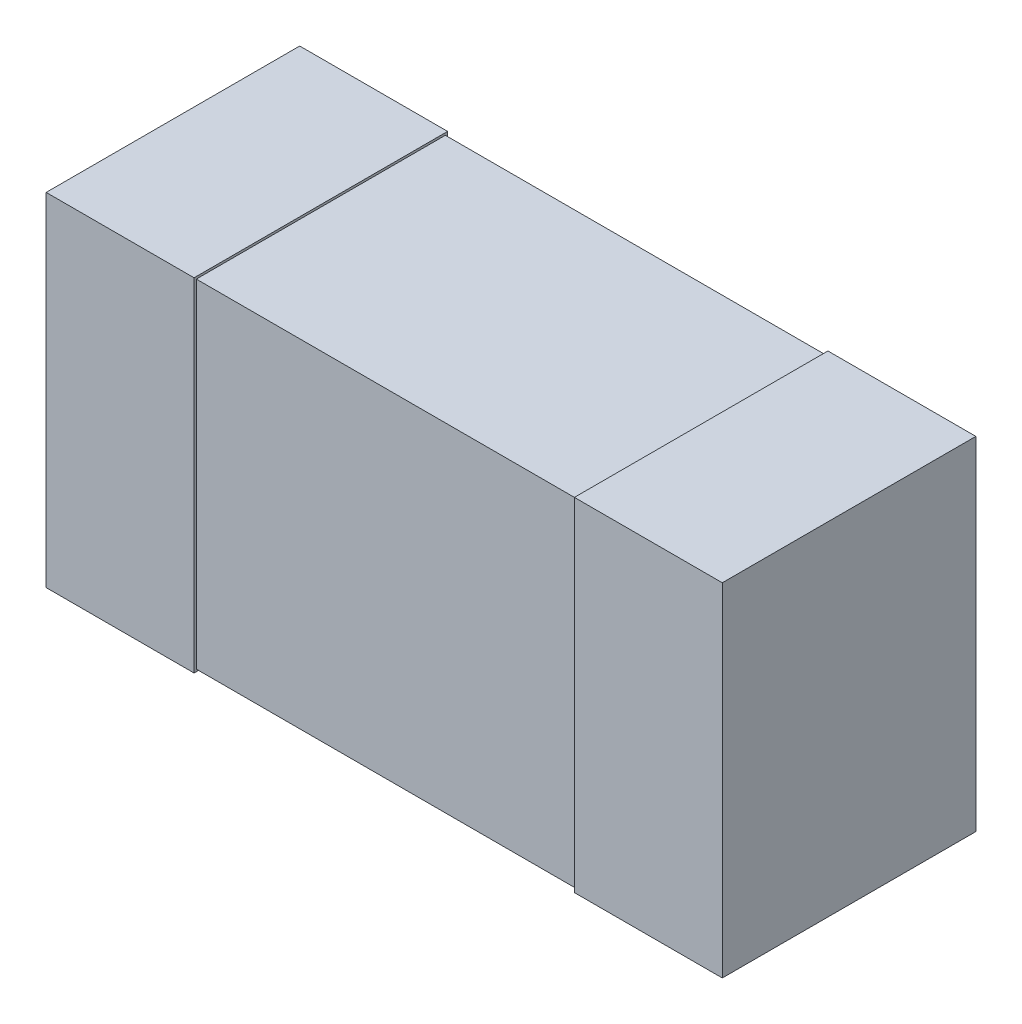
ISO-10303-21;
HEADER;
FILE_DESCRIPTION(('STEP AP214'),'2;1');
FILE_NAME('part.step','',(''),(''),'','','');
FILE_SCHEMA(('AUTOMOTIVE_DESIGN { 1 0 10303 214 1 1 1 1 }'));
ENDSEC;
DATA;
#1=APPLICATION_CONTEXT('core data for automotive mechanical design processes');
#2=APPLICATION_PROTOCOL_DEFINITION('international standard','automotive_design',2000,#1);
#3=PRODUCT_CONTEXT('',#1,'mechanical');
#4=PRODUCT('Part','Part','',(#3));
#5=PRODUCT_RELATED_PRODUCT_CATEGORY('part','',(#4));
#6=PRODUCT_DEFINITION_FORMATION('','',#4);
#7=PRODUCT_DEFINITION_CONTEXT('part definition',#1,'design');
#8=PRODUCT_DEFINITION('design','',#6,#7);
#9=PRODUCT_DEFINITION_SHAPE('','',#8);
#10=(LENGTH_UNIT() NAMED_UNIT(*) SI_UNIT(.MILLI.,.METRE.));
#11=(NAMED_UNIT(*) PLANE_ANGLE_UNIT() SI_UNIT($,.RADIAN.));
#12=(NAMED_UNIT(*) SI_UNIT($,.STERADIAN.) SOLID_ANGLE_UNIT());
#13=UNCERTAINTY_MEASURE_WITH_UNIT(LENGTH_MEASURE(1.E-05),#10,'distance_accuracy_value','');
#14=(GEOMETRIC_REPRESENTATION_CONTEXT(3) GLOBAL_UNCERTAINTY_ASSIGNED_CONTEXT((#13)) GLOBAL_UNIT_ASSIGNED_CONTEXT((#10,
#11,#12)) REPRESENTATION_CONTEXT('',''));
#15=CARTESIAN_POINT('',(0.,0.,0.));
#16=DIRECTION('',(0.,0.,1.));
#17=DIRECTION('',(1.,0.,0.));
#18=AXIS2_PLACEMENT_3D('',#15,#16,#17);
#19=CARTESIAN_POINT('',(0.8,-0.405,0.0762));
#20=DIRECTION('',(1.,0.,0.));
#21=DIRECTION('',(0.,1.,0.));
#22=AXIS2_PLACEMENT_3D('',#19,#20,#21);
#23=PLANE('',#22);
#24=DIRECTION('',(0.,1.,0.));
#25=VECTOR('',#24,1.);
#26=CARTESIAN_POINT('',(0.8,-0.405,0.0762));
#27=LINE('',#26,#25);
#28=CARTESIAN_POINT('',(0.8,-0.405,0.0762));
#29=VERTEX_POINT('',#28);
#30=CARTESIAN_POINT('',(0.8,0.405,0.0762));
#31=VERTEX_POINT('',#30);
#32=EDGE_CURVE('E189',#29,#31,#27,.T.);
#33=ORIENTED_EDGE('',*,*,#32,.T.);
#34=DIRECTION('',(0.,0.,1.));
#35=VECTOR('',#34,1.);
#36=CARTESIAN_POINT('',(0.8,0.405,0.0762));
#37=LINE('',#36,#35);
#38=CARTESIAN_POINT('',(0.8,0.405,0.6762));
#39=VERTEX_POINT('',#38);
#40=EDGE_CURVE('E205',#31,#39,#37,.T.);
#41=ORIENTED_EDGE('',*,*,#40,.T.);
#42=DIRECTION('',(0.,1.,0.));
#43=VECTOR('',#42,1.);
#44=CARTESIAN_POINT('',(0.8,-0.405,0.6762));
#45=LINE('',#44,#43);
#46=CARTESIAN_POINT('',(0.8,-0.405,0.6762));
#47=VERTEX_POINT('',#46);
#48=EDGE_CURVE('E224',#47,#39,#45,.T.);
#49=ORIENTED_EDGE('',*,*,#48,.F.);
#50=DIRECTION('',(0.,0.,1.));
#51=VECTOR('',#50,1.);
#52=CARTESIAN_POINT('',(0.8,-0.405,0.0762));
#53=LINE('',#52,#51);
#54=EDGE_CURVE('E11',#29,#47,#53,.T.);
#55=ORIENTED_EDGE('',*,*,#54,.F.);
#56=EDGE_LOOP('',(#33,#41,#49,#55));
#57=FACE_BOUND('',#56,.T.);
#58=ADVANCED_FACE('F17',(#57),#23,.T.);
#59=CARTESIAN_POINT('',(-0.8,0.405,0.0762));
#60=DIRECTION('',(-1.,0.,0.));
#61=DIRECTION('',(0.,0.,1.));
#62=AXIS2_PLACEMENT_3D('',#59,#60,#61);
#63=PLANE('',#62);
#64=DIRECTION('',(0.,-1.,0.));
#65=VECTOR('',#64,1.);
#66=CARTESIAN_POINT('',(-0.8,0.405,0.0762));
#67=LINE('',#66,#65);
#68=CARTESIAN_POINT('',(-0.8,0.405,0.0762));
#69=VERTEX_POINT('',#68);
#70=CARTESIAN_POINT('',(-0.8,-0.405,0.0762));
#71=VERTEX_POINT('',#70);
#72=EDGE_CURVE('E203',#69,#71,#67,.T.);
#73=ORIENTED_EDGE('',*,*,#72,.T.);
#74=DIRECTION('',(0.,0.,1.));
#75=VECTOR('',#74,1.);
#76=CARTESIAN_POINT('',(-0.8,-0.405,0.0762));
#77=LINE('',#76,#75);
#78=CARTESIAN_POINT('',(-0.8,-0.405,0.6762));
#79=VERTEX_POINT('',#78);
#80=EDGE_CURVE('E28',#71,#79,#77,.T.);
#81=ORIENTED_EDGE('',*,*,#80,.T.);
#82=DIRECTION('',(0.,-1.,0.));
#83=VECTOR('',#82,1.);
#84=CARTESIAN_POINT('',(-0.8,0.405,0.6762));
#85=LINE('',#84,#83);
#86=CARTESIAN_POINT('',(-0.8,0.405,0.6762));
#87=VERTEX_POINT('',#86);
#88=EDGE_CURVE('E208',#87,#79,#85,.T.);
#89=ORIENTED_EDGE('',*,*,#88,.F.);
#90=DIRECTION('',(0.,0.,1.));
#91=VECTOR('',#90,1.);
#92=CARTESIAN_POINT('',(-0.8,0.405,0.0762));
#93=LINE('',#92,#91);
#94=EDGE_CURVE('E181',#69,#87,#93,.T.);
#95=ORIENTED_EDGE('',*,*,#94,.F.);
#96=EDGE_LOOP('',(#73,#81,#89,#95));
#97=FACE_BOUND('',#96,.T.);
#98=ADVANCED_FACE('F19',(#97),#63,.T.);
#99=CARTESIAN_POINT('',(-0.8,-0.405,0.0762));
#100=DIRECTION('',(0.,-1.,0.));
#101=DIRECTION('',(0.,0.,-1.));
#102=AXIS2_PLACEMENT_3D('',#99,#100,#101);
#103=PLANE('',#102);
#104=DIRECTION('',(0.,0.,1.));
#105=VECTOR('',#104,1.);
#106=CARTESIAN_POINT('',(0.45,-0.405,0.0762));
#107=LINE('',#106,#105);
#108=CARTESIAN_POINT('',(0.45,-0.405,0.0762));
#109=VERTEX_POINT('',#108);
#110=CARTESIAN_POINT('',(0.45,-0.405,0.6762));
#111=VERTEX_POINT('',#110);
#112=EDGE_CURVE('E175',#109,#111,#107,.T.);
#113=ORIENTED_EDGE('',*,*,#112,.F.);
#114=DIRECTION('',(1.,0.,0.));
#115=VECTOR('',#114,1.);
#116=CARTESIAN_POINT('',(0.45,-0.405,0.0762));
#117=LINE('',#116,#115);
#118=EDGE_CURVE('E192',#109,#29,#117,.T.);
#119=ORIENTED_EDGE('',*,*,#118,.T.);
#120=ORIENTED_EDGE('',*,*,#54,.T.);
#121=DIRECTION('',(1.,0.,0.));
#122=VECTOR('',#121,1.);
#123=CARTESIAN_POINT('',(0.45,-0.405,0.6762));
#124=LINE('',#123,#122);
#125=EDGE_CURVE('E238',#111,#47,#124,.T.);
#126=ORIENTED_EDGE('',*,*,#125,.F.);
#127=EDGE_LOOP('',(#113,#119,#120,#126));
#128=FACE_BOUND('',#127,.T.);
#129=ADVANCED_FACE('F395',(#128),#103,.T.);
#130=CARTESIAN_POINT('',(-0.8,-0.405,0.0762));
#131=DIRECTION('',(0.,-1.,0.));
#132=DIRECTION('',(0.,0.,-1.));
#133=AXIS2_PLACEMENT_3D('',#130,#131,#132);
#134=PLANE('',#133);
#135=DIRECTION('',(0.,0.,1.));
#136=VECTOR('',#135,1.);
#137=CARTESIAN_POINT('',(-0.45,-0.405,0.0762));
#138=LINE('',#137,#136);
#139=CARTESIAN_POINT('',(-0.45,-0.405,0.0762));
#140=VERTEX_POINT('',#139);
#141=CARTESIAN_POINT('',(-0.45,-0.405,0.6762));
#142=VERTEX_POINT('',#141);
#143=EDGE_CURVE('E169',#140,#142,#138,.T.);
#144=ORIENTED_EDGE('',*,*,#143,.T.);
#145=DIRECTION('',(1.,0.,0.));
#146=VECTOR('',#145,1.);
#147=CARTESIAN_POINT('',(-0.8,-0.405,0.6762));
#148=LINE('',#147,#146);
#149=EDGE_CURVE('E228',#79,#142,#148,.T.);
#150=ORIENTED_EDGE('',*,*,#149,.F.);
#151=ORIENTED_EDGE('',*,*,#80,.F.);
#152=DIRECTION('',(1.,0.,0.));
#153=VECTOR('',#152,1.);
#154=CARTESIAN_POINT('',(-0.8,-0.405,0.0762));
#155=LINE('',#154,#153);
#156=EDGE_CURVE('E199',#71,#140,#155,.T.);
#157=ORIENTED_EDGE('',*,*,#156,.T.);
#158=EDGE_LOOP('',(#144,#150,#151,#157));
#159=FACE_BOUND('',#158,.T.);
#160=ADVANCED_FACE('F267',(#159),#134,.T.);
#161=CARTESIAN_POINT('',(0.,0.,0.6762));
#162=DIRECTION('',(0.,0.,1.));
#163=DIRECTION('',(1.,0.,0.));
#164=AXIS2_PLACEMENT_3D('',#161,#162,#163);
#165=PLANE('',#164);
#166=DIRECTION('',(0.,1.,0.));
#167=VECTOR('',#166,1.);
#168=CARTESIAN_POINT('',(0.45,-0.405,0.6762));
#169=LINE('',#168,#167);
#170=CARTESIAN_POINT('',(0.45,0.405,0.6762));
#171=VERTEX_POINT('',#170);
#172=EDGE_CURVE('E170',#111,#171,#169,.T.);
#173=ORIENTED_EDGE('',*,*,#172,.F.);
#174=ORIENTED_EDGE('',*,*,#125,.T.);
#175=ORIENTED_EDGE('',*,*,#48,.T.);
#176=DIRECTION('',(-1.,0.,0.));
#177=VECTOR('',#176,1.);
#178=CARTESIAN_POINT('',(0.8,0.405,0.6762));
#179=LINE('',#178,#177);
#180=EDGE_CURVE('E180',#39,#171,#179,.T.);
#181=ORIENTED_EDGE('',*,*,#180,.T.);
#182=EDGE_LOOP('',(#173,#174,#175,#181));
#183=FACE_BOUND('',#182,.T.);
#184=ADVANCED_FACE('F398',(#183),#165,.T.);
#185=CARTESIAN_POINT('',(0.,0.,0.6762));
#186=DIRECTION('',(0.,0.,1.));
#187=DIRECTION('',(1.,0.,0.));
#188=AXIS2_PLACEMENT_3D('',#185,#186,#187);
#189=PLANE('',#188);
#190=DIRECTION('',(0.,1.,0.));
#191=VECTOR('',#190,1.);
#192=CARTESIAN_POINT('',(-0.45,-0.405,0.6762));
#193=LINE('',#192,#191);
#194=CARTESIAN_POINT('',(-0.45,0.405,0.6762));
#195=VERTEX_POINT('',#194);
#196=EDGE_CURVE('E21',#142,#195,#193,.T.);
#197=ORIENTED_EDGE('',*,*,#196,.T.);
#198=DIRECTION('',(-1.,0.,0.));
#199=VECTOR('',#198,1.);
#200=CARTESIAN_POINT('',(-0.45,0.405,0.6762));
#201=LINE('',#200,#199);
#202=EDGE_CURVE('E176',#195,#87,#201,.T.);
#203=ORIENTED_EDGE('',*,*,#202,.T.);
#204=ORIENTED_EDGE('',*,*,#88,.T.);
#205=ORIENTED_EDGE('',*,*,#149,.T.);
#206=EDGE_LOOP('',(#197,#203,#204,#205));
#207=FACE_BOUND('',#206,.T.);
#208=ADVANCED_FACE('F264',(#207),#189,.T.);
#209=CARTESIAN_POINT('',(0.8,0.405,0.0762));
#210=DIRECTION('',(0.,1.,0.));
#211=DIRECTION('',(1.,0.,0.));
#212=AXIS2_PLACEMENT_3D('',#209,#210,#211);
#213=PLANE('',#212);
#214=DIRECTION('',(0.,0.,1.));
#215=VECTOR('',#214,1.);
#216=CARTESIAN_POINT('',(0.45,0.405,0.0762));
#217=LINE('',#216,#215);
#218=CARTESIAN_POINT('',(0.45,0.405,0.0762));
#219=VERTEX_POINT('',#218);
#220=EDGE_CURVE('E174',#219,#171,#217,.T.);
#221=ORIENTED_EDGE('',*,*,#220,.T.);
#222=ORIENTED_EDGE('',*,*,#180,.F.);
#223=ORIENTED_EDGE('',*,*,#40,.F.);
#224=DIRECTION('',(-1.,0.,0.));
#225=VECTOR('',#224,1.);
#226=CARTESIAN_POINT('',(0.8,0.405,0.0762));
#227=LINE('',#226,#225);
#228=EDGE_CURVE('E186',#31,#219,#227,.T.);
#229=ORIENTED_EDGE('',*,*,#228,.T.);
#230=EDGE_LOOP('',(#221,#222,#223,#229));
#231=FACE_BOUND('',#230,.T.);
#232=ADVANCED_FACE('F405',(#231),#213,.T.);
#233=CARTESIAN_POINT('',(0.8,0.405,0.0762));
#234=DIRECTION('',(0.,1.,0.));
#235=DIRECTION('',(1.,0.,0.));
#236=AXIS2_PLACEMENT_3D('',#233,#234,#235);
#237=PLANE('',#236);
#238=DIRECTION('',(0.,0.,1.));
#239=VECTOR('',#238,1.);
#240=CARTESIAN_POINT('',(-0.45,0.405,0.0762));
#241=LINE('',#240,#239);
#242=CARTESIAN_POINT('',(-0.45,0.405,0.0762));
#243=VERTEX_POINT('',#242);
#244=EDGE_CURVE('E195',#243,#195,#241,.T.);
#245=ORIENTED_EDGE('',*,*,#244,.F.);
#246=DIRECTION('',(-1.,0.,0.));
#247=VECTOR('',#246,1.);
#248=CARTESIAN_POINT('',(-0.45,0.405,0.0762));
#249=LINE('',#248,#247);
#250=EDGE_CURVE('E213',#243,#69,#249,.T.);
#251=ORIENTED_EDGE('',*,*,#250,.T.);
#252=ORIENTED_EDGE('',*,*,#94,.T.);
#253=ORIENTED_EDGE('',*,*,#202,.F.);
#254=EDGE_LOOP('',(#245,#251,#252,#253));
#255=FACE_BOUND('',#254,.T.);
#256=ADVANCED_FACE('F402',(#255),#237,.T.);
#257=CARTESIAN_POINT('',(0.45,-0.405,0.081534));
#258=DIRECTION('',(1.,0.,0.));
#259=DIRECTION('',(0.,1.,0.));
#260=AXIS2_PLACEMENT_3D('',#257,#258,#259);
#261=PLANE('',#260);
#262=DIRECTION('',(0.,1.,0.));
#263=VECTOR('',#262,1.);
#264=CARTESIAN_POINT('',(0.45,-0.399666,0.081534));
#265=LINE('',#264,#263);
#266=CARTESIAN_POINT('',(0.45,-0.399666,0.081534));
#267=VERTEX_POINT('',#266);
#268=CARTESIAN_POINT('',(0.45,0.399666,0.081534));
#269=VERTEX_POINT('',#268);
#270=EDGE_CURVE('E185',#267,#269,#265,.T.);
#271=ORIENTED_EDGE('',*,*,#270,.T.);
#272=DIRECTION('',(0.,0.,1.));
#273=VECTOR('',#272,1.);
#274=CARTESIAN_POINT('',(0.45,0.399666,0.081534));
#275=LINE('',#274,#273);
#276=CARTESIAN_POINT('',(0.45,0.399666,0.670866));
#277=VERTEX_POINT('',#276);
#278=EDGE_CURVE('E136',#269,#277,#275,.T.);
#279=ORIENTED_EDGE('',*,*,#278,.T.);
#280=DIRECTION('',(0.,-1.,0.));
#281=VECTOR('',#280,1.);
#282=CARTESIAN_POINT('',(0.45,0.399666,0.670866));
#283=LINE('',#282,#281);
#284=CARTESIAN_POINT('',(0.45,-0.399666,0.670866));
#285=VERTEX_POINT('',#284);
#286=EDGE_CURVE('E139',#277,#285,#283,.T.);
#287=ORIENTED_EDGE('',*,*,#286,.T.);
#288=DIRECTION('',(0.,0.,-1.));
#289=VECTOR('',#288,1.);
#290=CARTESIAN_POINT('',(0.45,-0.399666,0.670866));
#291=LINE('',#290,#289);
#292=EDGE_CURVE('E221',#285,#267,#291,.T.);
#293=ORIENTED_EDGE('',*,*,#292,.T.);
#294=EDGE_LOOP('',(#271,#279,#287,#293));
#295=FACE_BOUND('',#294,.T.);
#296=DIRECTION('',(0.,1.,0.));
#297=VECTOR('',#296,1.);
#298=CARTESIAN_POINT('',(0.45,-0.405,0.0762));
#299=LINE('',#298,#297);
#300=EDGE_CURVE('E190',#109,#219,#299,.T.);
#301=ORIENTED_EDGE('',*,*,#300,.F.);
#302=ORIENTED_EDGE('',*,*,#112,.T.);
#303=ORIENTED_EDGE('',*,*,#172,.T.);
#304=ORIENTED_EDGE('',*,*,#220,.F.);
#305=EDGE_LOOP('',(#301,#302,#303,#304));
#306=FACE_BOUND('',#305,.T.);
#307=ADVANCED_FACE('F372',(#295,#306),#261,.F.);
#308=CARTESIAN_POINT('',(-0.45,-0.405,0.081534));
#309=DIRECTION('',(0.,0.,1.));
#310=DIRECTION('',(1.,0.,0.));
#311=AXIS2_PLACEMENT_3D('',#308,#309,#310);
#312=PLANE('',#311);
#313=DIRECTION('',(1.,0.,0.));
#314=VECTOR('',#313,1.);
#315=CARTESIAN_POINT('',(-0.45,-0.399666,0.081534));
#316=LINE('',#315,#314);
#317=CARTESIAN_POINT('',(-0.45,-0.399666,0.081534));
#318=VERTEX_POINT('',#317);
#319=EDGE_CURVE('E144',#318,#267,#316,.T.);
#320=ORIENTED_EDGE('',*,*,#319,.F.);
#321=DIRECTION('',(0.,1.,0.));
#322=VECTOR('',#321,1.);
#323=CARTESIAN_POINT('',(-0.45,-0.399666,0.081534));
#324=LINE('',#323,#322);
#325=CARTESIAN_POINT('',(-0.45,0.399666,0.081534));
#326=VERTEX_POINT('',#325);
#327=EDGE_CURVE('E141',#318,#326,#324,.T.);
#328=ORIENTED_EDGE('',*,*,#327,.T.);
#329=DIRECTION('',(1.,0.,0.));
#330=VECTOR('',#329,1.);
#331=CARTESIAN_POINT('',(-0.45,0.399666,0.081534));
#332=LINE('',#331,#330);
#333=EDGE_CURVE('E129',#326,#269,#332,.T.);
#334=ORIENTED_EDGE('',*,*,#333,.T.);
#335=ORIENTED_EDGE('',*,*,#270,.F.);
#336=EDGE_LOOP('',(#320,#328,#334,#335));
#337=FACE_BOUND('',#336,.T.);
#338=ADVANCED_FACE('F142',(#337),#312,.F.);
#339=CARTESIAN_POINT('',(-0.45,0.399666,0.0762));
#340=DIRECTION('',(0.,-1.,0.));
#341=DIRECTION('',(0.,0.,-1.));
#342=AXIS2_PLACEMENT_3D('',#339,#340,#341);
#343=PLANE('',#342);
#344=ORIENTED_EDGE('',*,*,#333,.F.);
#345=DIRECTION('',(0.,0.,1.));
#346=VECTOR('',#345,1.);
#347=CARTESIAN_POINT('',(-0.45,0.399666,0.081534));
#348=LINE('',#347,#346);
#349=CARTESIAN_POINT('',(-0.45,0.399666,0.670866));
#350=VERTEX_POINT('',#349);
#351=EDGE_CURVE('E134',#326,#350,#348,.T.);
#352=ORIENTED_EDGE('',*,*,#351,.T.);
#353=DIRECTION('',(1.,0.,0.));
#354=VECTOR('',#353,1.);
#355=CARTESIAN_POINT('',(-0.45,0.399666,0.670866));
#356=LINE('',#355,#354);
#357=EDGE_CURVE('E165',#350,#277,#356,.T.);
#358=ORIENTED_EDGE('',*,*,#357,.T.);
#359=ORIENTED_EDGE('',*,*,#278,.F.);
#360=EDGE_LOOP('',(#344,#352,#358,#359));
#361=FACE_BOUND('',#360,.T.);
#362=ADVANCED_FACE('F131',(#361),#343,.F.);
#363=CARTESIAN_POINT('',(-0.45,0.405,0.670866));
#364=DIRECTION('',(0.,0.,-1.));
#365=DIRECTION('',(0.,-1.,0.));
#366=AXIS2_PLACEMENT_3D('',#363,#364,#365);
#367=PLANE('',#366);
#368=ORIENTED_EDGE('',*,*,#357,.F.);
#369=DIRECTION('',(0.,-1.,0.));
#370=VECTOR('',#369,1.);
#371=CARTESIAN_POINT('',(-0.45,0.399666,0.670866));
#372=LINE('',#371,#370);
#373=CARTESIAN_POINT('',(-0.45,-0.399666,0.670866));
#374=VERTEX_POINT('',#373);
#375=EDGE_CURVE('E154',#350,#374,#372,.T.);
#376=ORIENTED_EDGE('',*,*,#375,.T.);
#377=DIRECTION('',(1.,0.,0.));
#378=VECTOR('',#377,1.);
#379=CARTESIAN_POINT('',(-0.45,-0.399666,0.670866));
#380=LINE('',#379,#378);
#381=EDGE_CURVE('E149',#374,#285,#380,.T.);
#382=ORIENTED_EDGE('',*,*,#381,.T.);
#383=ORIENTED_EDGE('',*,*,#286,.F.);
#384=EDGE_LOOP('',(#368,#376,#382,#383));
#385=FACE_BOUND('',#384,.T.);
#386=ADVANCED_FACE('F371',(#385),#367,.F.);
#387=CARTESIAN_POINT('',(-0.45,-0.399666,0.6762));
#388=DIRECTION('',(0.,1.,0.));
#389=DIRECTION('',(1.,0.,0.));
#390=AXIS2_PLACEMENT_3D('',#387,#388,#389);
#391=PLANE('',#390);
#392=ORIENTED_EDGE('',*,*,#381,.F.);
#393=DIRECTION('',(0.,0.,-1.));
#394=VECTOR('',#393,1.);
#395=CARTESIAN_POINT('',(-0.45,-0.399666,0.670866));
#396=LINE('',#395,#394);
#397=EDGE_CURVE('E161',#374,#318,#396,.T.);
#398=ORIENTED_EDGE('',*,*,#397,.T.);
#399=ORIENTED_EDGE('',*,*,#319,.T.);
#400=ORIENTED_EDGE('',*,*,#292,.F.);
#401=EDGE_LOOP('',(#392,#398,#399,#400));
#402=FACE_BOUND('',#401,.T.);
#403=ADVANCED_FACE('F375',(#402),#391,.F.);
#404=CARTESIAN_POINT('',(-0.45,-0.405,0.0762));
#405=DIRECTION('',(-1.,0.,0.));
#406=DIRECTION('',(0.,0.,1.));
#407=AXIS2_PLACEMENT_3D('',#404,#405,#406);
#408=PLANE('',#407);
#409=ORIENTED_EDGE('',*,*,#397,.F.);
#410=ORIENTED_EDGE('',*,*,#375,.F.);
#411=ORIENTED_EDGE('',*,*,#351,.F.);
#412=ORIENTED_EDGE('',*,*,#327,.F.);
#413=EDGE_LOOP('',(#409,#410,#411,#412));
#414=FACE_BOUND('',#413,.T.);
#415=DIRECTION('',(0.,1.,0.));
#416=VECTOR('',#415,1.);
#417=CARTESIAN_POINT('',(-0.45,-0.405,0.0762));
#418=LINE('',#417,#416);
#419=EDGE_CURVE('E204',#140,#243,#418,.T.);
#420=ORIENTED_EDGE('',*,*,#419,.T.);
#421=ORIENTED_EDGE('',*,*,#244,.T.);
#422=ORIENTED_EDGE('',*,*,#196,.F.);
#423=ORIENTED_EDGE('',*,*,#143,.F.);
#424=EDGE_LOOP('',(#420,#421,#422,#423));
#425=FACE_BOUND('',#424,.T.);
#426=ADVANCED_FACE('F151',(#414,#425),#408,.F.);
#427=CARTESIAN_POINT('',(0.,0.,0.0762));
#428=DIRECTION('',(0.,0.,1.));
#429=DIRECTION('',(1.,0.,0.));
#430=AXIS2_PLACEMENT_3D('',#427,#428,#429);
#431=PLANE('',#430);
#432=ORIENTED_EDGE('',*,*,#300,.T.);
#433=ORIENTED_EDGE('',*,*,#228,.F.);
#434=ORIENTED_EDGE('',*,*,#32,.F.);
#435=ORIENTED_EDGE('',*,*,#118,.F.);
#436=EDGE_LOOP('',(#432,#433,#434,#435));
#437=FACE_BOUND('',#436,.T.);
#438=ADVANCED_FACE('F383',(#437),#431,.F.);
#439=CARTESIAN_POINT('',(0.,0.,0.0762));
#440=DIRECTION('',(0.,0.,1.));
#441=DIRECTION('',(1.,0.,0.));
#442=AXIS2_PLACEMENT_3D('',#439,#440,#441);
#443=PLANE('',#442);
#444=ORIENTED_EDGE('',*,*,#419,.F.);
#445=ORIENTED_EDGE('',*,*,#156,.F.);
#446=ORIENTED_EDGE('',*,*,#72,.F.);
#447=ORIENTED_EDGE('',*,*,#250,.F.);
#448=EDGE_LOOP('',(#444,#445,#446,#447));
#449=FACE_BOUND('',#448,.T.);
#450=ADVANCED_FACE('F413',(#449),#443,.F.);
#451=CLOSED_SHELL('',(#58,#98,#129,#160,#184,#208,#232,#256,#307,#338,#362,#386,#403,#426,#438,#450));
#452=MANIFOLD_SOLID_BREP('B1',#451);
#453=ADVANCED_BREP_SHAPE_REPRESENTATION('',(#18,#452),#14);
#454=SHAPE_DEFINITION_REPRESENTATION(#9,#453);
ENDSEC;
END-ISO-10303-21;
